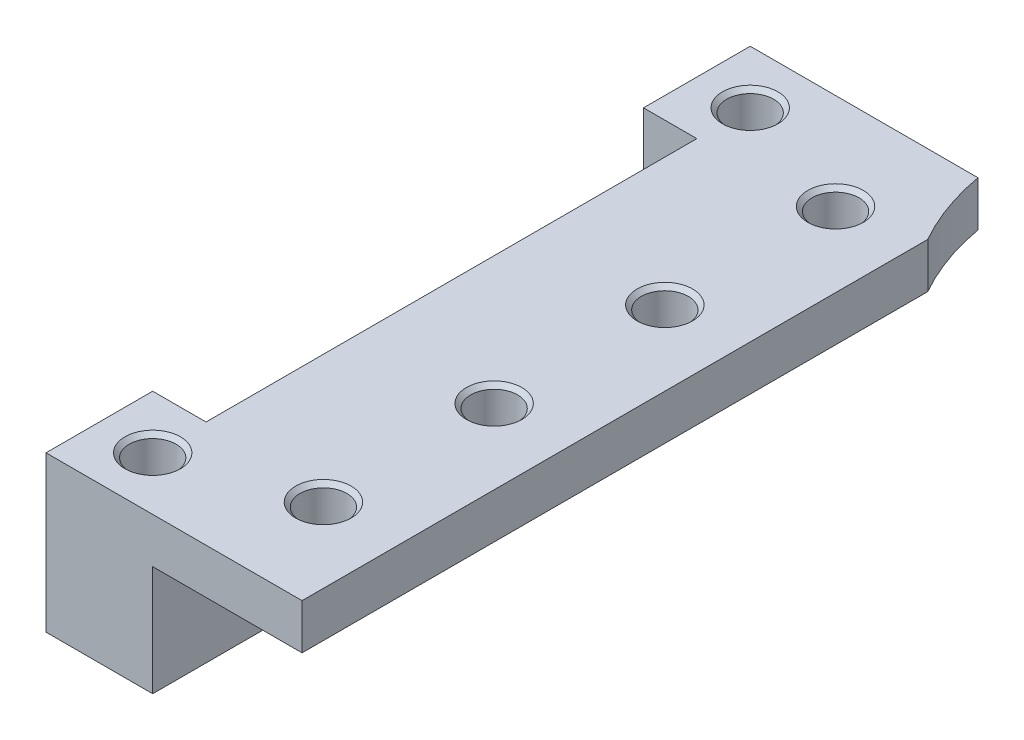
ISO-10303-21;
HEADER;
FILE_DESCRIPTION(('STEP AP214'),'2;1');
FILE_NAME('part.step','',(''),(''),'','','');
FILE_SCHEMA(('AUTOMOTIVE_DESIGN { 1 0 10303 214 1 1 1 1 }'));
ENDSEC;
DATA;
#1=APPLICATION_CONTEXT('core data for automotive mechanical design processes');
#2=APPLICATION_PROTOCOL_DEFINITION('international standard','automotive_design',2000,#1);
#3=PRODUCT_CONTEXT('',#1,'mechanical');
#4=PRODUCT('Part','Part','',(#3));
#5=PRODUCT_RELATED_PRODUCT_CATEGORY('part','',(#4));
#6=PRODUCT_DEFINITION_FORMATION('','',#4);
#7=PRODUCT_DEFINITION_CONTEXT('part definition',#1,'design');
#8=PRODUCT_DEFINITION('design','',#6,#7);
#9=PRODUCT_DEFINITION_SHAPE('','',#8);
#10=(LENGTH_UNIT() NAMED_UNIT(*) SI_UNIT(.MILLI.,.METRE.));
#11=(NAMED_UNIT(*) PLANE_ANGLE_UNIT() SI_UNIT($,.RADIAN.));
#12=(NAMED_UNIT(*) SI_UNIT($,.STERADIAN.) SOLID_ANGLE_UNIT());
#13=UNCERTAINTY_MEASURE_WITH_UNIT(LENGTH_MEASURE(1.E-05),#10,'distance_accuracy_value','');
#14=(GEOMETRIC_REPRESENTATION_CONTEXT(3) GLOBAL_UNCERTAINTY_ASSIGNED_CONTEXT((#13)) GLOBAL_UNIT_ASSIGNED_CONTEXT((#10,
#11,#12)) REPRESENTATION_CONTEXT('',''));
#15=CARTESIAN_POINT('',(0.,0.,0.));
#16=DIRECTION('',(0.,0.,1.));
#17=DIRECTION('',(1.,0.,0.));
#18=AXIS2_PLACEMENT_3D('',#15,#16,#17);
#19=CARTESIAN_POINT('',(0.,8.28,21.5));
#20=DIRECTION('',(0.,0.,1.));
#21=DIRECTION('',(1.,0.,0.));
#22=AXIS2_PLACEMENT_3D('',#19,#20,#21);
#23=PLANE('',#22);
#24=DIRECTION('',(0.,1.,0.));
#25=VECTOR('',#24,1.);
#26=CARTESIAN_POINT('',(10.,-2.72,21.5));
#27=LINE('',#26,#25);
#28=CARTESIAN_POINT('',(10.,5.16,21.5));
#29=VERTEX_POINT('',#28);
#30=CARTESIAN_POINT('',(10.,7.28,21.5));
#31=VERTEX_POINT('',#30);
#32=EDGE_CURVE('E122',#29,#31,#27,.T.);
#33=ORIENTED_EDGE('',*,*,#32,.T.);
#34=DIRECTION('',(1.,0.,0.));
#35=VECTOR('',#34,1.);
#36=CARTESIAN_POINT('',(22.,7.28,21.5));
#37=LINE('',#36,#35);
#38=CARTESIAN_POINT('',(-1.99999999999999,7.28,21.5));
#39=VERTEX_POINT('',#38);
#40=EDGE_CURVE('E129',#39,#31,#37,.T.);
#41=ORIENTED_EDGE('',*,*,#40,.F.);
#42=DIRECTION('',(0.,-1.,0.));
#43=VECTOR('',#42,1.);
#44=CARTESIAN_POINT('',(-1.99999999999999,8.28,21.5));
#45=LINE('',#44,#43);
#46=CARTESIAN_POINT('',(-1.99999999999999,0.,21.5));
#47=VERTEX_POINT('',#46);
#48=EDGE_CURVE('E221',#39,#47,#45,.T.);
#49=ORIENTED_EDGE('',*,*,#48,.T.);
#50=DIRECTION('',(1.,0.,0.));
#51=VECTOR('',#50,1.);
#52=CARTESIAN_POINT('',(20.,0.,21.5));
#53=LINE('',#52,#51);
#54=CARTESIAN_POINT('',(3.00000000000001,0.,21.5));
#55=VERTEX_POINT('',#54);
#56=EDGE_CURVE('E200',#47,#55,#53,.T.);
#57=ORIENTED_EDGE('',*,*,#56,.T.);
#58=DIRECTION('',(0.,1.,0.));
#59=VECTOR('',#58,1.);
#60=CARTESIAN_POINT('',(3.00000000000001,0.,21.5));
#61=LINE('',#60,#59);
#62=CARTESIAN_POINT('',(3.00000000000001,5.16,21.5));
#63=VERTEX_POINT('',#62);
#64=EDGE_CURVE('E58',#55,#63,#61,.T.);
#65=ORIENTED_EDGE('',*,*,#64,.T.);
#66=DIRECTION('',(-1.,0.,0.));
#67=VECTOR('',#66,1.);
#68=CARTESIAN_POINT('',(10.,5.16,21.5));
#69=LINE('',#68,#67);
#70=EDGE_CURVE('E42',#29,#63,#69,.T.);
#71=ORIENTED_EDGE('',*,*,#70,.F.);
#72=EDGE_LOOP('',(#33,#41,#49,#57,#65,#71));
#73=FACE_BOUND('',#72,.T.);
#74=ADVANCED_FACE('F34',(#73),#23,.T.);
#75=CARTESIAN_POINT('',(20.,8.28,-13.5));
#76=DIRECTION('',(0.,-1.,0.));
#77=DIRECTION('',(0.,0.,-1.));
#78=AXIS2_PLACEMENT_3D('',#75,#76,#77);
#79=CYLINDRICAL_SURFACE('',#78,11.5);
#80=CARTESIAN_POINT('',(20.,7.28,-13.5));
#81=DIRECTION('',(0.,1.,0.));
#82=DIRECTION('',(0.,0.,1.));
#83=AXIS2_PLACEMENT_3D('',#80,#81,#82);
#84=CIRCLE('',#83,11.5);
#85=CARTESIAN_POINT('',(10.,7.28,-7.82109165419974));
#86=VERTEX_POINT('',#85);
#87=CARTESIAN_POINT('',(8.67524834709389,7.28,-11.5));
#88=VERTEX_POINT('',#87);
#89=EDGE_CURVE('E185',#86,#88,#84,.F.);
#90=ORIENTED_EDGE('',*,*,#89,.F.);
#91=DIRECTION('',(0.,-1.,0.));
#92=VECTOR('',#91,1.);
#93=CARTESIAN_POINT('',(10.,8.28,-7.82109165419974));
#94=LINE('',#93,#92);
#95=CARTESIAN_POINT('',(10.,5.16,-7.82109165419974));
#96=VERTEX_POINT('',#95);
#97=EDGE_CURVE('E11',#86,#96,#94,.T.);
#98=ORIENTED_EDGE('',*,*,#97,.T.);
#99=CARTESIAN_POINT('',(20.,5.16,-13.5));
#100=DIRECTION('',(0.,-1.,0.));
#101=DIRECTION('',(0.,0.,-1.));
#102=AXIS2_PLACEMENT_3D('',#99,#100,#101);
#103=CIRCLE('',#102,11.5);
#104=CARTESIAN_POINT('',(8.67524834709389,5.16,-11.5));
#105=VERTEX_POINT('',#104);
#106=EDGE_CURVE('E196',#105,#96,#103,.F.);
#107=ORIENTED_EDGE('',*,*,#106,.F.);
#108=DIRECTION('',(0.,-1.,0.));
#109=VECTOR('',#108,1.);
#110=CARTESIAN_POINT('',(8.67524834709389,8.28,-11.5));
#111=LINE('',#110,#109);
#112=EDGE_CURVE('E136',#88,#105,#111,.T.);
#113=ORIENTED_EDGE('',*,*,#112,.F.);
#114=EDGE_LOOP('',(#90,#98,#107,#113));
#115=FACE_BOUND('',#114,.T.);
#116=ADVANCED_FACE('F296',(#115),#79,.F.);
#117=CARTESIAN_POINT('',(20.,8.28,-11.5));
#118=DIRECTION('',(0.,0.,-1.));
#119=DIRECTION('',(-1.,0.,0.));
#120=AXIS2_PLACEMENT_3D('',#117,#118,#119);
#121=PLANE('',#120);
#122=DIRECTION('',(0.,-1.,0.));
#123=VECTOR('',#122,1.);
#124=CARTESIAN_POINT('',(-1.99999999999999,8.28,-11.5));
#125=LINE('',#124,#123);
#126=CARTESIAN_POINT('',(-1.99999999999999,7.28,-11.5));
#127=VERTEX_POINT('',#126);
#128=CARTESIAN_POINT('',(-1.99999999999999,0.,-11.5));
#129=VERTEX_POINT('',#128);
#130=EDGE_CURVE('E139',#127,#129,#125,.T.);
#131=ORIENTED_EDGE('',*,*,#130,.F.);
#132=DIRECTION('',(1.,0.,0.));
#133=VECTOR('',#132,1.);
#134=CARTESIAN_POINT('',(-1.99999999999999,7.28,-11.5));
#135=LINE('',#134,#133);
#136=EDGE_CURVE('E176',#127,#88,#135,.T.);
#137=ORIENTED_EDGE('',*,*,#136,.T.);
#138=ORIENTED_EDGE('',*,*,#112,.T.);
#139=DIRECTION('',(1.,0.,0.));
#140=VECTOR('',#139,1.);
#141=CARTESIAN_POINT('',(10.,5.16,-11.5));
#142=LINE('',#141,#140);
#143=CARTESIAN_POINT('',(3.00000000000001,5.16,-11.5));
#144=VERTEX_POINT('',#143);
#145=EDGE_CURVE('E187',#144,#105,#142,.T.);
#146=ORIENTED_EDGE('',*,*,#145,.F.);
#147=DIRECTION('',(0.,1.,0.));
#148=VECTOR('',#147,1.);
#149=CARTESIAN_POINT('',(3.00000000000001,0.,-11.5));
#150=LINE('',#149,#148);
#151=CARTESIAN_POINT('',(3.00000000000001,0.,-11.5));
#152=VERTEX_POINT('',#151);
#153=EDGE_CURVE('E190',#152,#144,#150,.T.);
#154=ORIENTED_EDGE('',*,*,#153,.F.);
#155=DIRECTION('',(1.,0.,0.));
#156=VECTOR('',#155,1.);
#157=CARTESIAN_POINT('',(20.,0.,-11.5));
#158=LINE('',#157,#156);
#159=EDGE_CURVE('E203',#129,#152,#158,.T.);
#160=ORIENTED_EDGE('',*,*,#159,.F.);
#161=EDGE_LOOP('',(#131,#137,#138,#146,#154,#160));
#162=FACE_BOUND('',#161,.T.);
#163=ADVANCED_FACE('F243',(#162),#121,.T.);
#164=CARTESIAN_POINT('',(-1.99999999999999,8.28,0.));
#165=DIRECTION('',(1.,0.,0.));
#166=DIRECTION('',(0.,0.,-1.));
#167=AXIS2_PLACEMENT_3D('',#164,#165,#166);
#168=PLANE('',#167);
#169=DIRECTION('',(0.,0.,-1.));
#170=VECTOR('',#169,1.);
#171=CARTESIAN_POINT('',(-1.99999999999999,7.28,21.5));
#172=LINE('',#171,#170);
#173=CARTESIAN_POINT('',(-1.99999999999999,7.28,-6.5));
#174=VERTEX_POINT('',#173);
#175=EDGE_CURVE('E146',#174,#127,#172,.T.);
#176=ORIENTED_EDGE('',*,*,#175,.T.);
#177=ORIENTED_EDGE('',*,*,#130,.T.);
#178=DIRECTION('',(0.,0.,1.));
#179=VECTOR('',#178,1.);
#180=CARTESIAN_POINT('',(-1.99999999999999,0.,0.));
#181=LINE('',#180,#179);
#182=CARTESIAN_POINT('',(-1.99999999999999,0.,-6.5));
#183=VERTEX_POINT('',#182);
#184=EDGE_CURVE('E206',#129,#183,#181,.T.);
#185=ORIENTED_EDGE('',*,*,#184,.T.);
#186=DIRECTION('',(0.,-1.,0.));
#187=VECTOR('',#186,1.);
#188=CARTESIAN_POINT('',(-1.99999999999999,8.28,-6.5));
#189=LINE('',#188,#187);
#190=EDGE_CURVE('E229',#174,#183,#189,.T.);
#191=ORIENTED_EDGE('',*,*,#190,.F.);
#192=EDGE_LOOP('',(#176,#177,#185,#191));
#193=FACE_BOUND('',#192,.T.);
#194=ADVANCED_FACE('F234',(#193),#168,.F.);
#195=CARTESIAN_POINT('',(20.,8.28,-6.5));
#196=DIRECTION('',(0.,0.,1.));
#197=DIRECTION('',(1.,0.,0.));
#198=AXIS2_PLACEMENT_3D('',#195,#196,#197);
#199=PLANE('',#198);
#200=DIRECTION('',(0.,-1.,0.));
#201=VECTOR('',#200,1.);
#202=CARTESIAN_POINT('',(0.500000000000007,8.28,-6.5));
#203=LINE('',#202,#201);
#204=CARTESIAN_POINT('',(0.500000000000008,7.28,-6.5));
#205=VERTEX_POINT('',#204);
#206=CARTESIAN_POINT('',(0.500000000000007,0.,-6.5));
#207=VERTEX_POINT('',#206);
#208=EDGE_CURVE('E227',#205,#207,#203,.T.);
#209=ORIENTED_EDGE('',*,*,#208,.F.);
#210=DIRECTION('',(-1.,0.,0.));
#211=VECTOR('',#210,1.);
#212=CARTESIAN_POINT('',(20.,7.28,-6.5));
#213=LINE('',#212,#211);
#214=EDGE_CURVE('E182',#205,#174,#213,.T.);
#215=ORIENTED_EDGE('',*,*,#214,.T.);
#216=ORIENTED_EDGE('',*,*,#190,.T.);
#217=DIRECTION('',(-1.,0.,0.));
#218=VECTOR('',#217,1.);
#219=CARTESIAN_POINT('',(20.,0.,-6.5));
#220=LINE('',#219,#218);
#221=EDGE_CURVE('E209',#207,#183,#220,.T.);
#222=ORIENTED_EDGE('',*,*,#221,.F.);
#223=EDGE_LOOP('',(#209,#215,#216,#222));
#224=FACE_BOUND('',#223,.T.);
#225=ADVANCED_FACE('F332',(#224),#199,.T.);
#226=CARTESIAN_POINT('',(0.500000000000007,8.28,0.));
#227=DIRECTION('',(1.,0.,0.));
#228=DIRECTION('',(0.,0.,-1.));
#229=AXIS2_PLACEMENT_3D('',#226,#227,#228);
#230=PLANE('',#229);
#231=DIRECTION('',(0.,0.,1.));
#232=VECTOR('',#231,1.);
#233=CARTESIAN_POINT('',(0.500000000000007,7.28,0.));
#234=LINE('',#233,#232);
#235=CARTESIAN_POINT('',(0.500000000000004,7.28,16.5));
#236=VERTEX_POINT('',#235);
#237=EDGE_CURVE('E180',#205,#236,#234,.T.);
#238=ORIENTED_EDGE('',*,*,#237,.F.);
#239=ORIENTED_EDGE('',*,*,#208,.T.);
#240=DIRECTION('',(0.,0.,1.));
#241=VECTOR('',#240,1.);
#242=CARTESIAN_POINT('',(0.500000000000007,0.,0.));
#243=LINE('',#242,#241);
#244=CARTESIAN_POINT('',(0.500000000000004,0.,16.5));
#245=VERTEX_POINT('',#244);
#246=EDGE_CURVE('E212',#207,#245,#243,.T.);
#247=ORIENTED_EDGE('',*,*,#246,.T.);
#248=DIRECTION('',(0.,-1.,0.));
#249=VECTOR('',#248,1.);
#250=CARTESIAN_POINT('',(0.500000000000004,8.28,16.5));
#251=LINE('',#250,#249);
#252=EDGE_CURVE('E225',#236,#245,#251,.T.);
#253=ORIENTED_EDGE('',*,*,#252,.F.);
#254=EDGE_LOOP('',(#238,#239,#247,#253));
#255=FACE_BOUND('',#254,.T.);
#256=ADVANCED_FACE('F328',(#255),#230,.F.);
#257=CARTESIAN_POINT('',(20.,8.28,16.5));
#258=DIRECTION('',(0.,0.,1.));
#259=DIRECTION('',(1.,0.,0.));
#260=AXIS2_PLACEMENT_3D('',#257,#258,#259);
#261=PLANE('',#260);
#262=DIRECTION('',(-1.,0.,0.));
#263=VECTOR('',#262,1.);
#264=CARTESIAN_POINT('',(20.,7.28,16.5));
#265=LINE('',#264,#263);
#266=CARTESIAN_POINT('',(-1.99999999999999,7.28,16.5));
#267=VERTEX_POINT('',#266);
#268=EDGE_CURVE('E50',#236,#267,#265,.T.);
#269=ORIENTED_EDGE('',*,*,#268,.F.);
#270=ORIENTED_EDGE('',*,*,#252,.T.);
#271=DIRECTION('',(-1.,0.,0.));
#272=VECTOR('',#271,1.);
#273=CARTESIAN_POINT('',(20.,0.,16.5));
#274=LINE('',#273,#272);
#275=CARTESIAN_POINT('',(-1.99999999999999,0.,16.5));
#276=VERTEX_POINT('',#275);
#277=EDGE_CURVE('E215',#245,#276,#274,.T.);
#278=ORIENTED_EDGE('',*,*,#277,.T.);
#279=DIRECTION('',(0.,-1.,0.));
#280=VECTOR('',#279,1.);
#281=CARTESIAN_POINT('',(-1.99999999999999,8.28,16.5));
#282=LINE('',#281,#280);
#283=EDGE_CURVE('E223',#267,#276,#282,.T.);
#284=ORIENTED_EDGE('',*,*,#283,.F.);
#285=EDGE_LOOP('',(#269,#270,#278,#284));
#286=FACE_BOUND('',#285,.T.);
#287=ADVANCED_FACE('F319',(#286),#261,.F.);
#288=CARTESIAN_POINT('',(-1.99999999999999,8.28,0.));
#289=DIRECTION('',(-1.,0.,0.));
#290=DIRECTION('',(0.,0.,1.));
#291=AXIS2_PLACEMENT_3D('',#288,#289,#290);
#292=PLANE('',#291);
#293=ORIENTED_EDGE('',*,*,#48,.F.);
#294=EDGE_CURVE('E134',#39,#267,#172,.T.);
#295=ORIENTED_EDGE('',*,*,#294,.T.);
#296=ORIENTED_EDGE('',*,*,#283,.T.);
#297=DIRECTION('',(0.,0.,-1.));
#298=VECTOR('',#297,1.);
#299=CARTESIAN_POINT('',(-1.99999999999999,0.,0.));
#300=LINE('',#299,#298);
#301=EDGE_CURVE('E218',#47,#276,#300,.T.);
#302=ORIENTED_EDGE('',*,*,#301,.F.);
#303=EDGE_LOOP('',(#293,#295,#296,#302));
#304=FACE_BOUND('',#303,.T.);
#305=ADVANCED_FACE('F313',(#304),#292,.T.);
#306=CARTESIAN_POINT('',(20.,0.,0.));
#307=DIRECTION('',(0.,1.,0.));
#308=DIRECTION('',(0.,0.,1.));
#309=AXIS2_PLACEMENT_3D('',#306,#307,#308);
#310=PLANE('',#309);
#311=CARTESIAN_POINT('',(0.500000000000007,0.,19.));
#312=DIRECTION('',(0.,1.,0.));
#313=DIRECTION('',(0.,0.,1.));
#314=AXIS2_PLACEMENT_3D('',#311,#312,#313);
#315=CIRCLE('',#314,1.1);
#316=CARTESIAN_POINT('',(0.500000000000007,0.,20.1));
#317=VERTEX_POINT('',#316);
#318=EDGE_CURVE('E258',#317,#317,#315,.T.);
#319=ORIENTED_EDGE('',*,*,#318,.T.);
#320=EDGE_LOOP('',(#319));
#321=FACE_BOUND('',#320,.T.);
#322=CARTESIAN_POINT('',(0.500000000000007,0.,-9.));
#323=DIRECTION('',(0.,1.,0.));
#324=DIRECTION('',(0.,0.,1.));
#325=AXIS2_PLACEMENT_3D('',#322,#323,#324);
#326=CIRCLE('',#325,1.1);
#327=CARTESIAN_POINT('',(0.500000000000007,0.,-7.9));
#328=VERTEX_POINT('',#327);
#329=EDGE_CURVE('E267',#328,#328,#326,.T.);
#330=ORIENTED_EDGE('',*,*,#329,.T.);
#331=EDGE_LOOP('',(#330));
#332=FACE_BOUND('',#331,.T.);
#333=DIRECTION('',(0.,0.,1.));
#334=VECTOR('',#333,1.);
#335=CARTESIAN_POINT('',(3.00000000000001,0.,-11.5));
#336=LINE('',#335,#334);
#337=EDGE_CURVE('E194',#152,#55,#336,.T.);
#338=ORIENTED_EDGE('',*,*,#337,.T.);
#339=ORIENTED_EDGE('',*,*,#56,.F.);
#340=ORIENTED_EDGE('',*,*,#301,.T.);
#341=ORIENTED_EDGE('',*,*,#277,.F.);
#342=ORIENTED_EDGE('',*,*,#246,.F.);
#343=ORIENTED_EDGE('',*,*,#221,.T.);
#344=ORIENTED_EDGE('',*,*,#184,.F.);
#345=ORIENTED_EDGE('',*,*,#159,.T.);
#346=EDGE_LOOP('',(#338,#339,#340,#341,#342,#343,#344,#345));
#347=FACE_BOUND('',#346,.T.);
#348=ADVANCED_FACE('F239',(#321,#332,#347),#310,.F.);
#349=CARTESIAN_POINT('',(10.,5.16,-11.5));
#350=DIRECTION('',(0.,1.,0.));
#351=DIRECTION('',(0.,0.,1.));
#352=AXIS2_PLACEMENT_3D('',#349,#350,#351);
#353=PLANE('',#352);
#354=CARTESIAN_POINT('',(6.50000000000001,5.16,17.));
#355=DIRECTION('',(0.,1.,0.));
#356=DIRECTION('',(0.,0.,1.));
#357=AXIS2_PLACEMENT_3D('',#354,#355,#356);
#358=CIRCLE('',#357,1.1);
#359=CARTESIAN_POINT('',(6.50000000000001,5.16,18.1));
#360=VERTEX_POINT('',#359);
#361=EDGE_CURVE('E37',#360,#360,#358,.T.);
#362=ORIENTED_EDGE('',*,*,#361,.T.);
#363=EDGE_LOOP('',(#362));
#364=FACE_BOUND('',#363,.T.);
#365=CARTESIAN_POINT('',(6.50000000000001,5.16,9.));
#366=DIRECTION('',(0.,1.,0.));
#367=DIRECTION('',(0.,0.,1.));
#368=AXIS2_PLACEMENT_3D('',#365,#366,#367);
#369=CIRCLE('',#368,1.1);
#370=CARTESIAN_POINT('',(6.50000000000001,5.16,10.1));
#371=VERTEX_POINT('',#370);
#372=EDGE_CURVE('E152',#371,#371,#369,.T.);
#373=ORIENTED_EDGE('',*,*,#372,.T.);
#374=EDGE_LOOP('',(#373));
#375=FACE_BOUND('',#374,.T.);
#376=CARTESIAN_POINT('',(6.50000000000001,5.16,1.));
#377=DIRECTION('',(0.,1.,0.));
#378=DIRECTION('',(0.,0.,1.));
#379=AXIS2_PLACEMENT_3D('',#376,#377,#378);
#380=CIRCLE('',#379,1.1);
#381=CARTESIAN_POINT('',(6.50000000000001,5.16,2.1));
#382=VERTEX_POINT('',#381);
#383=EDGE_CURVE('E148',#382,#382,#380,.T.);
#384=ORIENTED_EDGE('',*,*,#383,.T.);
#385=EDGE_LOOP('',(#384));
#386=FACE_BOUND('',#385,.T.);
#387=CARTESIAN_POINT('',(6.50000000000001,5.16,-7.));
#388=DIRECTION('',(0.,1.,0.));
#389=DIRECTION('',(0.,0.,1.));
#390=AXIS2_PLACEMENT_3D('',#387,#388,#389);
#391=CIRCLE('',#390,1.1);
#392=CARTESIAN_POINT('',(6.50000000000001,5.16,-5.9));
#393=VERTEX_POINT('',#392);
#394=EDGE_CURVE('E143',#393,#393,#391,.T.);
#395=ORIENTED_EDGE('',*,*,#394,.T.);
#396=EDGE_LOOP('',(#395));
#397=FACE_BOUND('',#396,.T.);
#398=ORIENTED_EDGE('',*,*,#106,.T.);
#399=DIRECTION('',(0.,0.,1.));
#400=VECTOR('',#399,1.);
#401=CARTESIAN_POINT('',(10.,5.16,-11.5));
#402=LINE('',#401,#400);
#403=EDGE_CURVE('E130',#96,#29,#402,.T.);
#404=ORIENTED_EDGE('',*,*,#403,.T.);
#405=ORIENTED_EDGE('',*,*,#70,.T.);
#406=DIRECTION('',(0.,0.,1.));
#407=VECTOR('',#406,1.);
#408=CARTESIAN_POINT('',(3.00000000000001,5.16,-11.5));
#409=LINE('',#408,#407);
#410=EDGE_CURVE('E192',#144,#63,#409,.T.);
#411=ORIENTED_EDGE('',*,*,#410,.F.);
#412=ORIENTED_EDGE('',*,*,#145,.T.);
#413=EDGE_LOOP('',(#398,#404,#405,#411,#412));
#414=FACE_BOUND('',#413,.T.);
#415=ADVANCED_FACE('F248',(#364,#375,#386,#397,#414),#353,.F.);
#416=CARTESIAN_POINT('',(0.,7.28,0.));
#417=DIRECTION('',(0.,1.,0.));
#418=DIRECTION('',(0.,0.,1.));
#419=AXIS2_PLACEMENT_3D('',#416,#417,#418);
#420=PLANE('',#419);
#421=DIRECTION('',(0.,0.,1.));
#422=VECTOR('',#421,1.);
#423=CARTESIAN_POINT('',(10.,7.28,21.5));
#424=LINE('',#423,#422);
#425=EDGE_CURVE('E119',#86,#31,#424,.T.);
#426=ORIENTED_EDGE('',*,*,#425,.F.);
#427=ORIENTED_EDGE('',*,*,#89,.T.);
#428=ORIENTED_EDGE('',*,*,#136,.F.);
#429=ORIENTED_EDGE('',*,*,#175,.F.);
#430=ORIENTED_EDGE('',*,*,#214,.F.);
#431=ORIENTED_EDGE('',*,*,#237,.T.);
#432=ORIENTED_EDGE('',*,*,#268,.T.);
#433=ORIENTED_EDGE('',*,*,#294,.F.);
#434=ORIENTED_EDGE('',*,*,#40,.T.);
#435=EDGE_LOOP('',(#426,#427,#428,#429,#430,#431,#432,#433,#434));
#436=FACE_BOUND('',#435,.T.);
#437=CARTESIAN_POINT('',(0.500000000000007,7.28,19.));
#438=DIRECTION('',(0.,1.,0.));
#439=DIRECTION('',(0.,0.,1.));
#440=AXIS2_PLACEMENT_3D('',#437,#438,#439);
#441=CIRCLE('',#440,1.3);
#442=CARTESIAN_POINT('',(0.500000000000007,7.28,20.3));
#443=VERTEX_POINT('',#442);
#444=EDGE_CURVE('E250',#443,#443,#441,.T.);
#445=ORIENTED_EDGE('',*,*,#444,.F.);
#446=EDGE_LOOP('',(#445));
#447=FACE_BOUND('',#446,.T.);
#448=CARTESIAN_POINT('',(0.500000000000007,7.28,-9.));
#449=DIRECTION('',(0.,1.,0.));
#450=DIRECTION('',(0.,0.,1.));
#451=AXIS2_PLACEMENT_3D('',#448,#449,#450);
#452=CIRCLE('',#451,1.3);
#453=CARTESIAN_POINT('',(0.500000000000007,7.28,-7.7));
#454=VERTEX_POINT('',#453);
#455=EDGE_CURVE('E261',#454,#454,#452,.T.);
#456=ORIENTED_EDGE('',*,*,#455,.F.);
#457=EDGE_LOOP('',(#456));
#458=FACE_BOUND('',#457,.T.);
#459=CARTESIAN_POINT('',(6.50000000000001,7.28,17.));
#460=DIRECTION('',(0.,1.,0.));
#461=DIRECTION('',(0.,0.,1.));
#462=AXIS2_PLACEMENT_3D('',#459,#460,#461);
#463=CIRCLE('',#462,1.3);
#464=CARTESIAN_POINT('',(6.50000000000001,7.28,18.3));
#465=VERTEX_POINT('',#464);
#466=EDGE_CURVE('E270',#465,#465,#463,.T.);
#467=ORIENTED_EDGE('',*,*,#466,.F.);
#468=EDGE_LOOP('',(#467));
#469=FACE_BOUND('',#468,.T.);
#470=CARTESIAN_POINT('',(6.50000000000001,7.28,9.));
#471=DIRECTION('',(0.,1.,0.));
#472=DIRECTION('',(0.,0.,1.));
#473=AXIS2_PLACEMENT_3D('',#470,#471,#472);
#474=CIRCLE('',#473,1.3);
#475=CARTESIAN_POINT('',(6.50000000000001,7.28,10.3));
#476=VERTEX_POINT('',#475);
#477=EDGE_CURVE('E161',#476,#476,#474,.T.);
#478=ORIENTED_EDGE('',*,*,#477,.F.);
#479=EDGE_LOOP('',(#478));
#480=FACE_BOUND('',#479,.T.);
#481=CARTESIAN_POINT('',(6.50000000000001,7.28,1.));
#482=DIRECTION('',(0.,1.,0.));
#483=DIRECTION('',(0.,0.,1.));
#484=AXIS2_PLACEMENT_3D('',#481,#482,#483);
#485=CIRCLE('',#484,1.3);
#486=CARTESIAN_POINT('',(6.50000000000001,7.28,2.3));
#487=VERTEX_POINT('',#486);
#488=EDGE_CURVE('E154',#487,#487,#485,.T.);
#489=ORIENTED_EDGE('',*,*,#488,.F.);
#490=EDGE_LOOP('',(#489));
#491=FACE_BOUND('',#490,.T.);
#492=CARTESIAN_POINT('',(6.50000000000001,7.28,-7.));
#493=DIRECTION('',(0.,1.,0.));
#494=DIRECTION('',(0.,0.,1.));
#495=AXIS2_PLACEMENT_3D('',#492,#493,#494);
#496=CIRCLE('',#495,1.3);
#497=CARTESIAN_POINT('',(6.50000000000001,7.28,-5.7));
#498=VERTEX_POINT('',#497);
#499=EDGE_CURVE('E150',#498,#498,#496,.T.);
#500=ORIENTED_EDGE('',*,*,#499,.F.);
#501=EDGE_LOOP('',(#500));
#502=FACE_BOUND('',#501,.T.);
#503=ADVANCED_FACE('F132',(#436,#447,#458,#469,#480,#491,#502),#420,.T.);
#504=CARTESIAN_POINT('',(3.00000000000001,0.,-11.5));
#505=DIRECTION('',(1.,0.,0.));
#506=DIRECTION('',(0.,0.,-1.));
#507=AXIS2_PLACEMENT_3D('',#504,#505,#506);
#508=PLANE('',#507);
#509=ORIENTED_EDGE('',*,*,#64,.F.);
#510=ORIENTED_EDGE('',*,*,#337,.F.);
#511=ORIENTED_EDGE('',*,*,#153,.T.);
#512=ORIENTED_EDGE('',*,*,#410,.T.);
#513=EDGE_LOOP('',(#509,#510,#511,#512));
#514=FACE_BOUND('',#513,.T.);
#515=ADVANCED_FACE('F246',(#514),#508,.T.);
#516=CARTESIAN_POINT('',(6.50000000000001,7.28,-7.));
#517=DIRECTION('',(0.,1.,0.));
#518=DIRECTION('',(0.,0.,1.));
#519=AXIS2_PLACEMENT_3D('',#516,#517,#518);
#520=CYLINDRICAL_SURFACE('',#519,1.1);
#521=CARTESIAN_POINT('',(6.50000000000001,7.08,-7.));
#522=DIRECTION('',(0.,1.,0.));
#523=DIRECTION('',(0.,0.,1.));
#524=AXIS2_PLACEMENT_3D('',#521,#522,#523);
#525=CIRCLE('',#524,1.1);
#526=CARTESIAN_POINT('',(6.50000000000001,7.08,-5.9));
#527=VERTEX_POINT('',#526);
#528=EDGE_CURVE('E147',#527,#527,#525,.T.);
#529=ORIENTED_EDGE('',*,*,#528,.T.);
#530=EDGE_LOOP('',(#529));
#531=FACE_BOUND('',#530,.T.);
#532=ORIENTED_EDGE('',*,*,#394,.F.);
#533=EDGE_LOOP('',(#532));
#534=FACE_BOUND('',#533,.T.);
#535=ADVANCED_FACE('F372',(#531,#534),#520,.F.);
#536=CARTESIAN_POINT('',(6.50000000000001,7.28,-7.));
#537=DIRECTION('',(0.,1.,0.));
#538=DIRECTION('',(0.,0.,1.));
#539=AXIS2_PLACEMENT_3D('',#536,#537,#538);
#540=CONICAL_SURFACE('',#539,1.3,0.785398163397446);
#541=ORIENTED_EDGE('',*,*,#528,.F.);
#542=EDGE_LOOP('',(#541));
#543=FACE_BOUND('',#542,.T.);
#544=ORIENTED_EDGE('',*,*,#499,.T.);
#545=EDGE_LOOP('',(#544));
#546=FACE_BOUND('',#545,.T.);
#547=ADVANCED_FACE('F380',(#543,#546),#540,.F.);
#548=CARTESIAN_POINT('',(6.50000000000001,7.28,1.));
#549=DIRECTION('',(0.,1.,0.));
#550=DIRECTION('',(0.,0.,1.));
#551=AXIS2_PLACEMENT_3D('',#548,#549,#550);
#552=CYLINDRICAL_SURFACE('',#551,1.1);
#553=CARTESIAN_POINT('',(6.50000000000001,7.08,1.));
#554=DIRECTION('',(0.,1.,0.));
#555=DIRECTION('',(0.,0.,1.));
#556=AXIS2_PLACEMENT_3D('',#553,#554,#555);
#557=CIRCLE('',#556,1.1);
#558=CARTESIAN_POINT('',(6.50000000000001,7.08,2.1));
#559=VERTEX_POINT('',#558);
#560=EDGE_CURVE('E151',#559,#559,#557,.T.);
#561=ORIENTED_EDGE('',*,*,#560,.T.);
#562=EDGE_LOOP('',(#561));
#563=FACE_BOUND('',#562,.T.);
#564=ORIENTED_EDGE('',*,*,#383,.F.);
#565=EDGE_LOOP('',(#564));
#566=FACE_BOUND('',#565,.T.);
#567=ADVANCED_FACE('F390',(#563,#566),#552,.F.);
#568=CARTESIAN_POINT('',(6.50000000000001,7.28,1.));
#569=DIRECTION('',(0.,1.,0.));
#570=DIRECTION('',(0.,0.,1.));
#571=AXIS2_PLACEMENT_3D('',#568,#569,#570);
#572=CONICAL_SURFACE('',#571,1.3,0.785398163397446);
#573=ORIENTED_EDGE('',*,*,#560,.F.);
#574=EDGE_LOOP('',(#573));
#575=FACE_BOUND('',#574,.T.);
#576=ORIENTED_EDGE('',*,*,#488,.T.);
#577=EDGE_LOOP('',(#576));
#578=FACE_BOUND('',#577,.T.);
#579=ADVANCED_FACE('F400',(#575,#578),#572,.F.);
#580=CARTESIAN_POINT('',(6.50000000000001,7.28,9.));
#581=DIRECTION('',(0.,1.,0.));
#582=DIRECTION('',(0.,0.,1.));
#583=AXIS2_PLACEMENT_3D('',#580,#581,#582);
#584=CYLINDRICAL_SURFACE('',#583,1.1);
#585=CARTESIAN_POINT('',(6.50000000000001,7.08,9.));
#586=DIRECTION('',(0.,1.,0.));
#587=DIRECTION('',(0.,0.,1.));
#588=AXIS2_PLACEMENT_3D('',#585,#586,#587);
#589=CIRCLE('',#588,1.1);
#590=CARTESIAN_POINT('',(6.50000000000001,7.08,10.1));
#591=VERTEX_POINT('',#590);
#592=EDGE_CURVE('E155',#591,#591,#589,.T.);
#593=ORIENTED_EDGE('',*,*,#592,.T.);
#594=EDGE_LOOP('',(#593));
#595=FACE_BOUND('',#594,.T.);
#596=ORIENTED_EDGE('',*,*,#372,.F.);
#597=EDGE_LOOP('',(#596));
#598=FACE_BOUND('',#597,.T.);
#599=ADVANCED_FACE('F292',(#595,#598),#584,.F.);
#600=CARTESIAN_POINT('',(6.50000000000001,7.28,9.));
#601=DIRECTION('',(0.,1.,0.));
#602=DIRECTION('',(0.,0.,1.));
#603=AXIS2_PLACEMENT_3D('',#600,#601,#602);
#604=CONICAL_SURFACE('',#603,1.3,0.785398163397446);
#605=ORIENTED_EDGE('',*,*,#592,.F.);
#606=EDGE_LOOP('',(#605));
#607=FACE_BOUND('',#606,.T.);
#608=ORIENTED_EDGE('',*,*,#477,.T.);
#609=EDGE_LOOP('',(#608));
#610=FACE_BOUND('',#609,.T.);
#611=ADVANCED_FACE('F283',(#607,#610),#604,.F.);
#612=CARTESIAN_POINT('',(6.50000000000001,7.28,17.));
#613=DIRECTION('',(0.,1.,0.));
#614=DIRECTION('',(0.,0.,1.));
#615=AXIS2_PLACEMENT_3D('',#612,#613,#614);
#616=CYLINDRICAL_SURFACE('',#615,1.1);
#617=CARTESIAN_POINT('',(6.50000000000001,7.08,17.));
#618=DIRECTION('',(0.,1.,0.));
#619=DIRECTION('',(0.,0.,1.));
#620=AXIS2_PLACEMENT_3D('',#617,#618,#619);
#621=CIRCLE('',#620,1.1);
#622=CARTESIAN_POINT('',(6.50000000000001,7.08,18.1));
#623=VERTEX_POINT('',#622);
#624=EDGE_CURVE('E272',#623,#623,#621,.T.);
#625=ORIENTED_EDGE('',*,*,#624,.T.);
#626=EDGE_LOOP('',(#625));
#627=FACE_BOUND('',#626,.T.);
#628=ORIENTED_EDGE('',*,*,#361,.F.);
#629=EDGE_LOOP('',(#628));
#630=FACE_BOUND('',#629,.T.);
#631=ADVANCED_FACE('F280',(#627,#630),#616,.F.);
#632=CARTESIAN_POINT('',(6.50000000000001,7.28,17.));
#633=DIRECTION('',(0.,1.,0.));
#634=DIRECTION('',(0.,0.,1.));
#635=AXIS2_PLACEMENT_3D('',#632,#633,#634);
#636=CONICAL_SURFACE('',#635,1.3,0.785398163397446);
#637=ORIENTED_EDGE('',*,*,#624,.F.);
#638=EDGE_LOOP('',(#637));
#639=FACE_BOUND('',#638,.T.);
#640=ORIENTED_EDGE('',*,*,#466,.T.);
#641=EDGE_LOOP('',(#640));
#642=FACE_BOUND('',#641,.T.);
#643=ADVANCED_FACE('F282',(#639,#642),#636,.F.);
#644=CARTESIAN_POINT('',(0.500000000000007,7.28,-9.));
#645=DIRECTION('',(0.,1.,0.));
#646=DIRECTION('',(0.,0.,1.));
#647=AXIS2_PLACEMENT_3D('',#644,#645,#646);
#648=CYLINDRICAL_SURFACE('',#647,1.1);
#649=ORIENTED_EDGE('',*,*,#329,.F.);
#650=EDGE_LOOP('',(#649));
#651=FACE_BOUND('',#650,.T.);
#652=CARTESIAN_POINT('',(0.500000000000007,7.08,-9.));
#653=DIRECTION('',(0.,1.,0.));
#654=DIRECTION('',(0.,0.,1.));
#655=AXIS2_PLACEMENT_3D('',#652,#653,#654);
#656=CIRCLE('',#655,1.1);
#657=CARTESIAN_POINT('',(0.500000000000007,7.08,-7.9));
#658=VERTEX_POINT('',#657);
#659=EDGE_CURVE('E264',#658,#658,#656,.T.);
#660=ORIENTED_EDGE('',*,*,#659,.T.);
#661=EDGE_LOOP('',(#660));
#662=FACE_BOUND('',#661,.T.);
#663=ADVANCED_FACE('F289',(#651,#662),#648,.F.);
#664=CARTESIAN_POINT('',(0.500000000000007,7.28,-9.));
#665=DIRECTION('',(0.,1.,0.));
#666=DIRECTION('',(0.,0.,1.));
#667=AXIS2_PLACEMENT_3D('',#664,#665,#666);
#668=CONICAL_SURFACE('',#667,1.3,0.785398163397447);
#669=ORIENTED_EDGE('',*,*,#659,.F.);
#670=EDGE_LOOP('',(#669));
#671=FACE_BOUND('',#670,.T.);
#672=ORIENTED_EDGE('',*,*,#455,.T.);
#673=EDGE_LOOP('',(#672));
#674=FACE_BOUND('',#673,.T.);
#675=ADVANCED_FACE('F443',(#671,#674),#668,.F.);
#676=CARTESIAN_POINT('',(0.500000000000007,7.28,19.));
#677=DIRECTION('',(0.,1.,0.));
#678=DIRECTION('',(0.,0.,1.));
#679=AXIS2_PLACEMENT_3D('',#676,#677,#678);
#680=CYLINDRICAL_SURFACE('',#679,1.1);
#681=ORIENTED_EDGE('',*,*,#318,.F.);
#682=EDGE_LOOP('',(#681));
#683=FACE_BOUND('',#682,.T.);
#684=CARTESIAN_POINT('',(0.500000000000007,7.08,19.));
#685=DIRECTION('',(0.,1.,0.));
#686=DIRECTION('',(0.,0.,1.));
#687=AXIS2_PLACEMENT_3D('',#684,#685,#686);
#688=CIRCLE('',#687,1.1);
#689=CARTESIAN_POINT('',(0.500000000000007,7.08,20.1));
#690=VERTEX_POINT('',#689);
#691=EDGE_CURVE('E253',#690,#690,#688,.T.);
#692=ORIENTED_EDGE('',*,*,#691,.T.);
#693=EDGE_LOOP('',(#692));
#694=FACE_BOUND('',#693,.T.);
#695=ADVANCED_FACE('F453',(#683,#694),#680,.F.);
#696=CARTESIAN_POINT('',(0.500000000000007,7.28,19.));
#697=DIRECTION('',(0.,1.,0.));
#698=DIRECTION('',(0.,0.,1.));
#699=AXIS2_PLACEMENT_3D('',#696,#697,#698);
#700=CONICAL_SURFACE('',#699,1.3,0.785398163397447);
#701=ORIENTED_EDGE('',*,*,#691,.F.);
#702=EDGE_LOOP('',(#701));
#703=FACE_BOUND('',#702,.T.);
#704=ORIENTED_EDGE('',*,*,#444,.T.);
#705=EDGE_LOOP('',(#704));
#706=FACE_BOUND('',#705,.T.);
#707=ADVANCED_FACE('F463',(#703,#706),#700,.F.);
#708=CARTESIAN_POINT('',(10.,-2.72,21.5));
#709=DIRECTION('',(-1.,0.,0.));
#710=DIRECTION('',(0.,0.,1.));
#711=AXIS2_PLACEMENT_3D('',#708,#709,#710);
#712=PLANE('',#711);
#713=ORIENTED_EDGE('',*,*,#97,.F.);
#714=ORIENTED_EDGE('',*,*,#425,.T.);
#715=ORIENTED_EDGE('',*,*,#32,.F.);
#716=ORIENTED_EDGE('',*,*,#403,.F.);
#717=EDGE_LOOP('',(#713,#714,#715,#716));
#718=FACE_BOUND('',#717,.T.);
#719=ADVANCED_FACE('F121',(#718),#712,.F.);
#720=CLOSED_SHELL('',(#74,#116,#163,#194,#225,#256,#287,#305,#348,#415,#503,#515,#535,#547,#567,
#579,#599,#611,#631,#643,#663,#675,#695,#707,#719));
#721=MANIFOLD_SOLID_BREP('B2',#720);
#722=ADVANCED_BREP_SHAPE_REPRESENTATION('',(#18,#721),#14);
#723=SHAPE_DEFINITION_REPRESENTATION(#9,#722);
ENDSEC;
END-ISO-10303-21;
